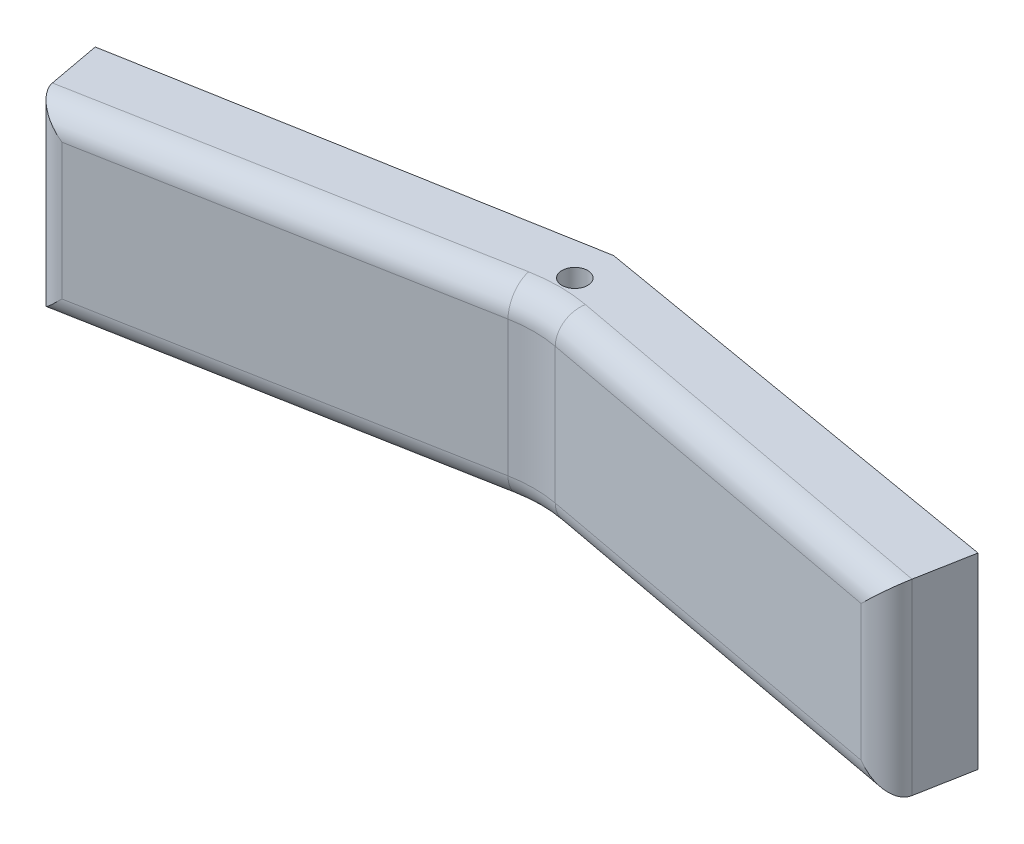
ISO-10303-21;
HEADER;
FILE_DESCRIPTION(('STEP AP214'),'2;1');
FILE_NAME('part.step','',(''),(''),'','','');
FILE_SCHEMA(('AUTOMOTIVE_DESIGN { 1 0 10303 214 1 1 1 1 }'));
ENDSEC;
DATA;
#1=APPLICATION_CONTEXT('core data for automotive mechanical design processes');
#2=APPLICATION_PROTOCOL_DEFINITION('international standard','automotive_design',2000,#1);
#3=PRODUCT_CONTEXT('',#1,'mechanical');
#4=PRODUCT('Part','Part','',(#3));
#5=PRODUCT_RELATED_PRODUCT_CATEGORY('part','',(#4));
#6=PRODUCT_DEFINITION_FORMATION('','',#4);
#7=PRODUCT_DEFINITION_CONTEXT('part definition',#1,'design');
#8=PRODUCT_DEFINITION('design','',#6,#7);
#9=PRODUCT_DEFINITION_SHAPE('','',#8);
#10=(LENGTH_UNIT() NAMED_UNIT(*) SI_UNIT(.MILLI.,.METRE.));
#11=(NAMED_UNIT(*) PLANE_ANGLE_UNIT() SI_UNIT($,.RADIAN.));
#12=(NAMED_UNIT(*) SI_UNIT($,.STERADIAN.) SOLID_ANGLE_UNIT());
#13=UNCERTAINTY_MEASURE_WITH_UNIT(LENGTH_MEASURE(1.E-05),#10,'distance_accuracy_value','');
#14=(GEOMETRIC_REPRESENTATION_CONTEXT(3) GLOBAL_UNCERTAINTY_ASSIGNED_CONTEXT((#13)) GLOBAL_UNIT_ASSIGNED_CONTEXT((#10,
#11,#12)) REPRESENTATION_CONTEXT('',''));
#15=CARTESIAN_POINT('',(0.,0.,0.));
#16=DIRECTION('',(0.,0.,1.));
#17=DIRECTION('',(1.,0.,0.));
#18=AXIS2_PLACEMENT_3D('',#15,#16,#17);
#19=CARTESIAN_POINT('',(70.,-30.,12.));
#20=DIRECTION('',(-0.182592193842776,0.,-0.983188736076488));
#21=DIRECTION('',(-0.983188736076488,0.,0.182592193842776));
#22=AXIS2_PLACEMENT_3D('',#19,#20,#21);
#23=PLANE('',#22);
#24=DIRECTION('',(0.,1.,0.));
#25=VECTOR('',#24,1.);
#26=CARTESIAN_POINT('',(8.14316476998033,-29.5,23.4876979712894));
#27=LINE('',#26,#25);
#28=CARTESIAN_POINT('',(8.14316476998033,-4.5,23.4876979712894));
#29=VERTEX_POINT('',#28);
#30=CARTESIAN_POINT('',(8.14316476998033,-25.5,23.4876979712894));
#31=VERTEX_POINT('',#30);
#32=EDGE_CURVE('E208',#29,#31,#27,.F.);
#33=ORIENTED_EDGE('',*,*,#32,.T.);
#34=DIRECTION('',(-0.983188736076488,0.,0.182592193842776));
#35=VECTOR('',#34,1.);
#36=CARTESIAN_POINT('',(66.3481561231445,-25.5,12.6781995771303));
#37=LINE('',#36,#35);
#38=CARTESIAN_POINT('',(66.3481561231445,-25.5,12.6781995771303));
#39=VERTEX_POINT('',#38);
#40=EDGE_CURVE('E211',#31,#39,#37,.F.);
#41=ORIENTED_EDGE('',*,*,#40,.T.);
#42=DIRECTION('',(0.,1.,0.));
#43=VECTOR('',#42,1.);
#44=CARTESIAN_POINT('',(66.3481561231445,-0.5,12.6781995771303));
#45=LINE('',#44,#43);
#46=CARTESIAN_POINT('',(66.3481561231445,-4.5,12.6781995771303));
#47=VERTEX_POINT('',#46);
#48=EDGE_CURVE('E181',#39,#47,#45,.T.);
#49=ORIENTED_EDGE('',*,*,#48,.T.);
#50=DIRECTION('',(0.983188736076488,0.,-0.182592193842776));
#51=VECTOR('',#50,1.);
#52=CARTESIAN_POINT('',(4.21040982567438,-4.5,24.2180667466605));
#53=LINE('',#52,#51);
#54=EDGE_CURVE('E205',#47,#29,#53,.F.);
#55=ORIENTED_EDGE('',*,*,#54,.T.);
#56=EDGE_LOOP('',(#33,#41,#49,#55));
#57=FACE_BOUND('',#56,.T.);
#58=ADVANCED_FACE('F47',(#57),#23,.F.);
#59=CARTESIAN_POINT('',(0.,-30.,12.5));
#60=DIRECTION('',(0.175790638483658,0.,0.984427575508482));
#61=DIRECTION('',(0.984427575508482,0.,-0.175790638483658));
#62=AXIS2_PLACEMENT_3D('',#59,#60,#61);
#63=PLANE('',#62);
#64=CARTESIAN_POINT('',(14.2813992262199,-15.,9.94975013817502));
#65=DIRECTION('',(-0.175790638483658,0.,-0.984427575508482));
#66=DIRECTION('',(-0.984427575508482,0.,0.175790638483658));
#67=AXIS2_PLACEMENT_3D('',#64,#65,#66);
#68=CIRCLE('',#67,2.5);
#69=CARTESIAN_POINT('',(11.8203302874487,-15.,10.3892267343842));
#70=VERTEX_POINT('',#69);
#71=EDGE_CURVE('E160',#70,#70,#68,.T.);
#72=ORIENTED_EDGE('',*,*,#71,.F.);
#73=EDGE_LOOP('',(#72));
#74=FACE_BOUND('',#73,.T.);
#75=DIRECTION('',(-0.984427575508482,0.,0.175790638483657));
#76=VECTOR('',#75,1.);
#77=CARTESIAN_POINT('',(70.,-0.5,0.));
#78=LINE('',#77,#76);
#79=CARTESIAN_POINT('',(70.,-0.5,0.));
#80=VERTEX_POINT('',#79);
#81=CARTESIAN_POINT('',(1.96890220372216,-0.5,12.1484103207639));
#82=VERTEX_POINT('',#81);
#83=EDGE_CURVE('E273',#80,#82,#78,.T.);
#84=ORIENTED_EDGE('',*,*,#83,.F.);
#85=DIRECTION('',(0.,1.,0.));
#86=VECTOR('',#85,1.);
#87=CARTESIAN_POINT('',(70.,-30.,0.));
#88=LINE('',#87,#86);
#89=CARTESIAN_POINT('',(70.,-29.5,0.));
#90=VERTEX_POINT('',#89);
#91=EDGE_CURVE('E151',#90,#80,#88,.T.);
#92=ORIENTED_EDGE('',*,*,#91,.F.);
#93=DIRECTION('',(0.984427575508482,0.,-0.175790638483657));
#94=VECTOR('',#93,1.);
#95=CARTESIAN_POINT('',(1.96890220372216,-29.5,12.1484103207639));
#96=LINE('',#95,#94);
#97=CARTESIAN_POINT('',(1.96890220372216,-29.5,12.1484103207639));
#98=VERTEX_POINT('',#97);
#99=EDGE_CURVE('E286',#98,#90,#96,.T.);
#100=ORIENTED_EDGE('',*,*,#99,.F.);
#101=DIRECTION('',(0.,-1.,0.));
#102=VECTOR('',#101,1.);
#103=CARTESIAN_POINT('',(1.96890220372216,-30.,12.1484103207639));
#104=LINE('',#103,#102);
#105=EDGE_CURVE('E177',#82,#98,#104,.T.);
#106=ORIENTED_EDGE('',*,*,#105,.F.);
#107=EDGE_LOOP('',(#84,#92,#100,#106));
#108=FACE_BOUND('',#107,.T.);
#109=ADVANCED_FACE('F334',(#74,#108),#63,.F.);
#110=CARTESIAN_POINT('',(70.,-30.,0.));
#111=DIRECTION('',(-0.168963815110846,0.,0.985622254813267));
#112=DIRECTION('',(0.985622254813267,0.,0.168963815110846));
#113=AXIS2_PLACEMENT_3D('',#110,#111,#112);
#114=PLANE('',#113);
#115=CARTESIAN_POINT('',(125.786219622431,-15.,9.56335193527388));
#116=DIRECTION('',(0.168963815110846,0.,-0.985622254813267));
#117=DIRECTION('',(-0.985622254813267,0.,-0.168963815110846));
#118=AXIS2_PLACEMENT_3D('',#115,#116,#117);
#119=CIRCLE('',#118,2.5);
#120=CARTESIAN_POINT('',(123.322163985398,-15.,9.14094239749676));
#121=VERTEX_POINT('',#120);
#122=EDGE_CURVE('E262',#121,#121,#119,.T.);
#123=ORIENTED_EDGE('',*,*,#122,.F.);
#124=EDGE_LOOP('',(#123));
#125=FACE_BOUND('',#124,.T.);
#126=DIRECTION('',(-0.985622254813267,0.,-0.168963815110846));
#127=VECTOR('',#126,1.);
#128=CARTESIAN_POINT('',(138.028566573112,-0.5,11.6620399839621));
#129=LINE('',#128,#127);
#130=CARTESIAN_POINT('',(138.028566573112,-0.5,11.6620399839621));
#131=VERTEX_POINT('',#130);
#132=EDGE_CURVE('E134',#131,#80,#129,.T.);
#133=ORIENTED_EDGE('',*,*,#132,.F.);
#134=DIRECTION('',(0.,1.,0.));
#135=VECTOR('',#134,1.);
#136=CARTESIAN_POINT('',(138.028566573112,-30.,11.6620399839621));
#137=LINE('',#136,#135);
#138=CARTESIAN_POINT('',(138.028566573112,-29.5,11.6620399839621));
#139=VERTEX_POINT('',#138);
#140=EDGE_CURVE('E149',#139,#131,#137,.T.);
#141=ORIENTED_EDGE('',*,*,#140,.F.);
#142=DIRECTION('',(0.985622254813267,0.,0.168963815110846));
#143=VECTOR('',#142,1.);
#144=CARTESIAN_POINT('',(70.,-29.5,0.));
#145=LINE('',#144,#143);
#146=EDGE_CURVE('E289',#90,#139,#145,.T.);
#147=ORIENTED_EDGE('',*,*,#146,.F.);
#148=ORIENTED_EDGE('',*,*,#91,.T.);
#149=EDGE_LOOP('',(#133,#141,#147,#148));
#150=FACE_BOUND('',#149,.T.);
#151=ADVANCED_FACE('F147',(#125,#150),#114,.F.);
#152=CARTESIAN_POINT('',(70.,-30.,12.));
#153=DIRECTION('',(0.182592193842776,0.,-0.983188736076488));
#154=DIRECTION('',(-0.983188736076488,0.,-0.182592193842776));
#155=AXIS2_PLACEMENT_3D('',#152,#153,#154);
#156=PLANE('',#155);
#157=DIRECTION('',(0.,1.,0.));
#158=VECTOR('',#157,1.);
#159=CARTESIAN_POINT('',(73.6518438768555,-29.5,12.6781995771303));
#160=LINE('',#159,#158);
#161=CARTESIAN_POINT('',(73.6518438768555,-4.5,12.6781995771303));
#162=VERTEX_POINT('',#161);
#163=CARTESIAN_POINT('',(73.6518438768555,-25.5,12.6781995771303));
#164=VERTEX_POINT('',#163);
#165=EDGE_CURVE('E185',#162,#164,#160,.F.);
#166=ORIENTED_EDGE('',*,*,#165,.T.);
#167=DIRECTION('',(-0.983188736076488,0.,-0.182592193842776));
#168=VECTOR('',#167,1.);
#169=CARTESIAN_POINT('',(135.699828880185,-25.5,24.2013967920343));
#170=LINE('',#169,#168);
#171=CARTESIAN_POINT('',(131.767073935879,-25.5,23.4710280166632));
#172=VERTEX_POINT('',#171);
#173=EDGE_CURVE('E57',#164,#172,#170,.F.);
#174=ORIENTED_EDGE('',*,*,#173,.T.);
#175=DIRECTION('',(0.,-1.,0.));
#176=VECTOR('',#175,1.);
#177=CARTESIAN_POINT('',(131.767073935879,-0.5,23.4710280166632));
#178=LINE('',#177,#176);
#179=CARTESIAN_POINT('',(131.767073935879,-4.5,23.4710280166632));
#180=VERTEX_POINT('',#179);
#181=EDGE_CURVE('E68',#172,#180,#178,.F.);
#182=ORIENTED_EDGE('',*,*,#181,.T.);
#183=DIRECTION('',(0.983188736076488,0.,0.182592193842776));
#184=VECTOR('',#183,1.);
#185=CARTESIAN_POINT('',(73.6518438768555,-4.5,12.6781995771303));
#186=LINE('',#185,#184);
#187=EDGE_CURVE('E225',#180,#162,#186,.F.);
#188=ORIENTED_EDGE('',*,*,#187,.T.);
#189=EDGE_LOOP('',(#166,#174,#182,#188));
#190=FACE_BOUND('',#189,.T.);
#191=ADVANCED_FACE('F342',(#190),#156,.F.);
#192=CARTESIAN_POINT('',(70.,0.,6.));
#193=DIRECTION('',(0.,-1.,0.));
#194=DIRECTION('',(0.,0.,-1.));
#195=AXIS2_PLACEMENT_3D('',#192,#193,#194);
#196=CYLINDRICAL_SURFACE('',#195,2.);
#197=CARTESIAN_POINT('',(70.,-29.5,6.));
#198=DIRECTION('',(0.,-1.,0.));
#199=DIRECTION('',(0.,0.,-1.));
#200=AXIS2_PLACEMENT_3D('',#197,#198,#199);
#201=CIRCLE('',#200,2.);
#202=CARTESIAN_POINT('',(70.,-29.5,4.));
#203=VERTEX_POINT('',#202);
#204=EDGE_CURVE('E161',#203,#203,#201,.F.);
#205=ORIENTED_EDGE('',*,*,#204,.F.);
#206=EDGE_LOOP('',(#205));
#207=FACE_BOUND('',#206,.T.);
#208=CARTESIAN_POINT('',(70.,-0.5,6.));
#209=DIRECTION('',(0.,1.,0.));
#210=DIRECTION('',(0.,0.,1.));
#211=AXIS2_PLACEMENT_3D('',#208,#209,#210);
#212=CIRCLE('',#211,2.);
#213=CARTESIAN_POINT('',(70.,-0.5,8.));
#214=VERTEX_POINT('',#213);
#215=EDGE_CURVE('E153',#214,#214,#212,.F.);
#216=ORIENTED_EDGE('',*,*,#215,.F.);
#217=EDGE_LOOP('',(#216));
#218=FACE_BOUND('',#217,.T.);
#219=ADVANCED_FACE('F348',(#207,#218),#196,.F.);
#220=CARTESIAN_POINT('',(135.520306291903,0.,25.168056882782));
#221=DIRECTION('',(0.983188736076488,0.,0.182592193842776));
#222=DIRECTION('',(0.182592193842776,0.,-0.983188736076488));
#223=AXIS2_PLACEMENT_3D('',#220,#221,#222);
#224=PLANE('',#223);
#225=DIRECTION('',(0.182592193842776,0.,-0.983188736076488));
#226=VECTOR('',#225,1.);
#227=CARTESIAN_POINT('',(135.699828880185,-0.5,24.2013967920343));
#228=LINE('',#227,#226);
#229=CARTESIAN_POINT('',(136.430197655556,-0.5,20.2686418477284));
#230=VERTEX_POINT('',#229);
#231=EDGE_CURVE('E129',#230,#131,#228,.T.);
#232=ORIENTED_EDGE('',*,*,#231,.F.);
#233=DIRECTION('',(0.,-1.,0.));
#234=VECTOR('',#233,1.);
#235=CARTESIAN_POINT('',(136.430197655556,-29.5,20.2686418477284));
#236=LINE('',#235,#234);
#237=CARTESIAN_POINT('',(136.430197655556,-29.5,20.2686418477284));
#238=VERTEX_POINT('',#237);
#239=EDGE_CURVE('E11',#230,#238,#236,.T.);
#240=ORIENTED_EDGE('',*,*,#239,.T.);
#241=DIRECTION('',(-0.182592193842776,0.,0.983188736076488));
#242=VECTOR('',#241,1.);
#243=CARTESIAN_POINT('',(138.028566573112,-29.5,11.6620399839621));
#244=LINE('',#243,#242);
#245=EDGE_CURVE('E158',#139,#238,#244,.T.);
#246=ORIENTED_EDGE('',*,*,#245,.F.);
#247=ORIENTED_EDGE('',*,*,#140,.T.);
#248=EDGE_LOOP('',(#232,#240,#246,#247));
#249=FACE_BOUND('',#248,.T.);
#250=ADVANCED_FACE('F156',(#249),#224,.T.);
#251=CARTESIAN_POINT('',(-0.277654881368432,0.,0.0515644779684231));
#252=DIRECTION('',(-0.983188736076488,0.,0.182592193842776));
#253=DIRECTION('',(0.182592193842776,0.,0.983188736076488));
#254=AXIS2_PLACEMENT_3D('',#251,#252,#253);
#255=PLANE('',#254);
#256=DIRECTION('',(-0.182592193842776,0.,-0.983188736076488));
#257=VECTOR('',#256,1.);
#258=CARTESIAN_POINT('',(4.21040982567438,-29.5,24.2180667466605));
#259=LINE('',#258,#257);
#260=CARTESIAN_POINT('',(3.48004105030327,-29.5,20.2853118023545));
#261=VERTEX_POINT('',#260);
#262=EDGE_CURVE('E283',#261,#98,#259,.T.);
#263=ORIENTED_EDGE('',*,*,#262,.F.);
#264=DIRECTION('',(0.,1.,0.));
#265=VECTOR('',#264,1.);
#266=CARTESIAN_POINT('',(3.48004105030327,-0.5,20.2853118023545));
#267=LINE('',#266,#265);
#268=CARTESIAN_POINT('',(3.48004105030327,-0.5,20.2853118023545));
#269=VERTEX_POINT('',#268);
#270=EDGE_CURVE('E214',#261,#269,#267,.T.);
#271=ORIENTED_EDGE('',*,*,#270,.T.);
#272=DIRECTION('',(0.182592193842776,0.,0.983188736076488));
#273=VECTOR('',#272,1.);
#274=CARTESIAN_POINT('',(1.96890220372216,-0.5,12.1484103207639));
#275=LINE('',#274,#273);
#276=EDGE_CURVE('E142',#82,#269,#275,.T.);
#277=ORIENTED_EDGE('',*,*,#276,.F.);
#278=ORIENTED_EDGE('',*,*,#105,.T.);
#279=EDGE_LOOP('',(#263,#271,#277,#278));
#280=FACE_BOUND('',#279,.T.);
#281=ADVANCED_FACE('F313',(#280),#255,.T.);
#282=CARTESIAN_POINT('',(14.8087711416709,-15.,12.9030328647005));
#283=DIRECTION('',(-0.175790638483658,0.,-0.984427575508482));
#284=DIRECTION('',(-0.984427575508482,0.,0.175790638483658));
#285=AXIS2_PLACEMENT_3D('',#282,#283,#284);
#286=CYLINDRICAL_SURFACE('',#285,2.5);
#287=CARTESIAN_POINT('',(14.8087711416709,-15.,12.9030328647005));
#288=DIRECTION('',(-0.175790638483658,0.,-0.984427575508482));
#289=DIRECTION('',(-0.984427575508482,0.,0.175790638483658));
#290=AXIS2_PLACEMENT_3D('',#287,#288,#289);
#291=CIRCLE('',#290,2.5);
#292=CARTESIAN_POINT('',(12.3477022028997,-15.,13.3425094609096));
#293=VERTEX_POINT('',#292);
#294=EDGE_CURVE('E166',#293,#293,#291,.T.);
#295=ORIENTED_EDGE('',*,*,#294,.F.);
#296=EDGE_LOOP('',(#295));
#297=FACE_BOUND('',#296,.T.);
#298=ORIENTED_EDGE('',*,*,#71,.T.);
#299=EDGE_LOOP('',(#298));
#300=FACE_BOUND('',#299,.T.);
#301=ADVANCED_FACE('F412',(#297,#300),#286,.F.);
#302=CARTESIAN_POINT('',(14.8087711416709,-15.,12.9030328647005));
#303=DIRECTION('',(-0.175790638483658,0.,-0.984427575508482));
#304=DIRECTION('',(-0.984427575508482,0.,0.175790638483658));
#305=AXIS2_PLACEMENT_3D('',#302,#303,#304);
#306=PLANE('',#305);
#307=ORIENTED_EDGE('',*,*,#294,.T.);
#308=EDGE_LOOP('',(#307));
#309=FACE_BOUND('',#308,.T.);
#310=ADVANCED_FACE('F405',(#309),#306,.T.);
#311=CARTESIAN_POINT('',(0.,-29.5,0.));
#312=DIRECTION('',(0.,-1.,0.));
#313=DIRECTION('',(0.,0.,-1.));
#314=AXIS2_PLACEMENT_3D('',#311,#312,#313);
#315=PLANE('',#314);
#316=CARTESIAN_POINT('',(70.,-29.5,32.3419742986601));
#317=DIRECTION('',(0.,-1.,0.));
#318=DIRECTION('',(0.,0.,-1.));
#319=AXIS2_PLACEMENT_3D('',#316,#317,#318);
#320=CIRCLE('',#319,24.);
#321=CARTESIAN_POINT('',(74.3822126522266,-29.5,8.74544463282436));
#322=VERTEX_POINT('',#321);
#323=CARTESIAN_POINT('',(65.6177873477734,-29.5,8.74544463282436));
#324=VERTEX_POINT('',#323);
#325=EDGE_CURVE('E191',#322,#324,#320,.F.);
#326=ORIENTED_EDGE('',*,*,#325,.T.);
#327=DIRECTION('',(-0.983188736076488,0.,0.182592193842776));
#328=VECTOR('',#327,1.);
#329=CARTESIAN_POINT('',(3.48004105030328,-29.5,20.2853118023545));
#330=LINE('',#329,#328);
#331=EDGE_CURVE('E195',#324,#261,#330,.T.);
#332=ORIENTED_EDGE('',*,*,#331,.T.);
#333=ORIENTED_EDGE('',*,*,#262,.T.);
#334=ORIENTED_EDGE('',*,*,#99,.T.);
#335=ORIENTED_EDGE('',*,*,#146,.T.);
#336=ORIENTED_EDGE('',*,*,#245,.T.);
#337=DIRECTION('',(-0.983188736076488,0.,-0.182592193842776));
#338=VECTOR('',#337,1.);
#339=CARTESIAN_POINT('',(74.3822126522266,-29.5,8.74544463282436));
#340=LINE('',#339,#338);
#341=EDGE_CURVE('E188',#238,#322,#340,.T.);
#342=ORIENTED_EDGE('',*,*,#341,.T.);
#343=EDGE_LOOP('',(#326,#332,#333,#334,#335,#336,#342));
#344=FACE_BOUND('',#343,.T.);
#345=ORIENTED_EDGE('',*,*,#204,.T.);
#346=EDGE_LOOP('',(#345));
#347=FACE_BOUND('',#346,.T.);
#348=ADVANCED_FACE('F294',(#344,#347),#315,.T.);
#349=CARTESIAN_POINT('',(0.,-0.5,0.));
#350=DIRECTION('',(0.,1.,0.));
#351=DIRECTION('',(0.,0.,1.));
#352=AXIS2_PLACEMENT_3D('',#349,#350,#351);
#353=PLANE('',#352);
#354=ORIENTED_EDGE('',*,*,#276,.T.);
#355=DIRECTION('',(0.983188736076488,0.,-0.182592193842776));
#356=VECTOR('',#355,1.);
#357=CARTESIAN_POINT('',(65.6177873477734,-0.5,8.74544463282436));
#358=LINE('',#357,#356);
#359=CARTESIAN_POINT('',(65.6177873477734,-0.5,8.74544463282436));
#360=VERTEX_POINT('',#359);
#361=EDGE_CURVE('E222',#269,#360,#358,.T.);
#362=ORIENTED_EDGE('',*,*,#361,.T.);
#363=CARTESIAN_POINT('',(70.,-0.5,32.3419742986601));
#364=DIRECTION('',(0.,1.,0.));
#365=DIRECTION('',(0.,0.,1.));
#366=AXIS2_PLACEMENT_3D('',#363,#364,#365);
#367=CIRCLE('',#366,24.);
#368=CARTESIAN_POINT('',(74.3822126522266,-0.5,8.74544463282436));
#369=VERTEX_POINT('',#368);
#370=EDGE_CURVE('E219',#360,#369,#367,.F.);
#371=ORIENTED_EDGE('',*,*,#370,.T.);
#372=DIRECTION('',(0.983188736076488,0.,0.182592193842776));
#373=VECTOR('',#372,1.);
#374=CARTESIAN_POINT('',(136.430197655556,-0.5,20.2686418477284));
#375=LINE('',#374,#373);
#376=EDGE_CURVE('E137',#369,#230,#375,.T.);
#377=ORIENTED_EDGE('',*,*,#376,.T.);
#378=ORIENTED_EDGE('',*,*,#231,.T.);
#379=ORIENTED_EDGE('',*,*,#132,.T.);
#380=ORIENTED_EDGE('',*,*,#83,.T.);
#381=EDGE_LOOP('',(#354,#362,#371,#377,#378,#379,#380));
#382=FACE_BOUND('',#381,.T.);
#383=ORIENTED_EDGE('',*,*,#215,.T.);
#384=EDGE_LOOP('',(#383));
#385=FACE_BOUND('',#384,.T.);
#386=ADVANCED_FACE('F132',(#382,#385),#353,.T.);
#387=CARTESIAN_POINT('',(125.279328177098,-15.,12.5202186997137));
#388=DIRECTION('',(0.168963815110846,0.,-0.985622254813267));
#389=DIRECTION('',(-0.985622254813267,0.,-0.168963815110846));
#390=AXIS2_PLACEMENT_3D('',#387,#388,#389);
#391=CYLINDRICAL_SURFACE('',#390,2.5);
#392=CARTESIAN_POINT('',(125.279328177098,-15.,12.5202186997137));
#393=DIRECTION('',(0.168963815110846,0.,-0.985622254813267));
#394=DIRECTION('',(-0.985622254813267,0.,-0.168963815110846));
#395=AXIS2_PLACEMENT_3D('',#392,#393,#394);
#396=CIRCLE('',#395,2.5);
#397=CARTESIAN_POINT('',(122.815272540065,-15.,12.0978091619366));
#398=VERTEX_POINT('',#397);
#399=EDGE_CURVE('E267',#398,#398,#396,.T.);
#400=ORIENTED_EDGE('',*,*,#399,.F.);
#401=EDGE_LOOP('',(#400));
#402=FACE_BOUND('',#401,.T.);
#403=ORIENTED_EDGE('',*,*,#122,.T.);
#404=EDGE_LOOP('',(#403));
#405=FACE_BOUND('',#404,.T.);
#406=ADVANCED_FACE('F384',(#402,#405),#391,.F.);
#407=CARTESIAN_POINT('',(125.279328177098,-15.,12.5202186997137));
#408=DIRECTION('',(0.168963815110846,0.,-0.985622254813267));
#409=DIRECTION('',(-0.985622254813267,0.,-0.168963815110846));
#410=AXIS2_PLACEMENT_3D('',#407,#408,#409);
#411=PLANE('',#410);
#412=ORIENTED_EDGE('',*,*,#399,.T.);
#413=EDGE_LOOP('',(#412));
#414=FACE_BOUND('',#413,.T.);
#415=ADVANCED_FACE('F355',(#414),#411,.T.);
#416=CARTESIAN_POINT('',(70.,-30.,32.3419742986601));
#417=DIRECTION('',(0.,-1.,0.));
#418=DIRECTION('',(0.,0.,-1.));
#419=AXIS2_PLACEMENT_3D('',#416,#417,#418);
#420=CYLINDRICAL_SURFACE('',#419,20.);
#421=ORIENTED_EDGE('',*,*,#48,.F.);
#422=CARTESIAN_POINT('',(70.,-25.5,32.3419742986601));
#423=DIRECTION('',(0.,-1.,0.));
#424=DIRECTION('',(0.,0.,-1.));
#425=AXIS2_PLACEMENT_3D('',#422,#423,#424);
#426=CIRCLE('',#425,20.);
#427=EDGE_CURVE('E201',#39,#164,#426,.T.);
#428=ORIENTED_EDGE('',*,*,#427,.T.);
#429=ORIENTED_EDGE('',*,*,#165,.F.);
#430=CARTESIAN_POINT('',(70.,-4.5,32.3419742986601));
#431=DIRECTION('',(0.,1.,0.));
#432=DIRECTION('',(0.,0.,1.));
#433=AXIS2_PLACEMENT_3D('',#430,#431,#432);
#434=CIRCLE('',#433,20.);
#435=EDGE_CURVE('E198',#162,#47,#434,.T.);
#436=ORIENTED_EDGE('',*,*,#435,.T.);
#437=EDGE_LOOP('',(#421,#428,#429,#436));
#438=FACE_BOUND('',#437,.T.);
#439=ADVANCED_FACE('F327',(#438),#420,.F.);
#440=CARTESIAN_POINT('',(70.,-4.5,32.3419742986601));
#441=DIRECTION('',(0.,1.,0.));
#442=DIRECTION('',(0.,0.,1.));
#443=AXIS2_PLACEMENT_3D('',#440,#441,#442);
#444=TOROIDAL_SURFACE('',#443,24.,4.);
#445=CARTESIAN_POINT('',(65.6177873477734,-4.5,8.74544463282436));
#446=DIRECTION('',(-0.983188736076488,0.,0.182592193842777));
#447=DIRECTION('',(0.182592193842777,0.,0.983188736076488));
#448=AXIS2_PLACEMENT_3D('',#445,#446,#447);
#449=CIRCLE('',#448,4.);
#450=EDGE_CURVE('E253',#47,#360,#449,.T.);
#451=ORIENTED_EDGE('',*,*,#450,.F.);
#452=ORIENTED_EDGE('',*,*,#435,.F.);
#453=CARTESIAN_POINT('',(74.3822126522266,-4.5,8.74544463282436));
#454=DIRECTION('',(0.983188736076488,0.,0.182592193842777));
#455=DIRECTION('',(0.182592193842777,0.,-0.983188736076488));
#456=AXIS2_PLACEMENT_3D('',#453,#454,#455);
#457=CIRCLE('',#456,4.);
#458=EDGE_CURVE('E51',#369,#162,#457,.T.);
#459=ORIENTED_EDGE('',*,*,#458,.F.);
#460=ORIENTED_EDGE('',*,*,#370,.F.);
#461=EDGE_LOOP('',(#451,#452,#459,#460));
#462=FACE_BOUND('',#461,.T.);
#463=ADVANCED_FACE('F49',(#462),#444,.T.);
#464=CARTESIAN_POINT('',(0.909891363652818,-4.5,-4.89941503505364));
#465=DIRECTION('',(-0.983188736076488,0.,-0.182592193842776));
#466=DIRECTION('',(-0.182592193842776,0.,0.983188736076488));
#467=AXIS2_PLACEMENT_3D('',#464,#465,#466);
#468=CYLINDRICAL_SURFACE('',#467,4.);
#469=ORIENTED_EDGE('',*,*,#458,.T.);
#470=ORIENTED_EDGE('',*,*,#187,.F.);
#471=CARTESIAN_POINT('',(132.49744271125,-4.5,19.5382730723573));
#472=DIRECTION('',(-0.695219422465915,0.707106781186547,-0.129112178457956));
#473=DIRECTION('',(-0.695219422465915,-0.707106781186547,-0.129112178457956));
#474=AXIS2_PLACEMENT_3D('',#471,#472,#473);
#475=ELLIPSE('',#474,5.65685424949238,4.);
#476=EDGE_CURVE('E250',#230,#180,#475,.F.);
#477=ORIENTED_EDGE('',*,*,#476,.F.);
#478=ORIENTED_EDGE('',*,*,#376,.F.);
#479=EDGE_LOOP('',(#469,#470,#477,#478));
#480=FACE_BOUND('',#479,.T.);
#481=ADVANCED_FACE('F367',(#480),#468,.T.);
#482=CARTESIAN_POINT('',(3.7576959316717,-4.5,20.2337473243861));
#483=DIRECTION('',(-0.983188736076488,0.,0.182592193842776));
#484=DIRECTION('',(0.182592193842776,0.,0.983188736076488));
#485=AXIS2_PLACEMENT_3D('',#482,#483,#484);
#486=CYLINDRICAL_SURFACE('',#485,4.);
#487=ORIENTED_EDGE('',*,*,#450,.T.);
#488=ORIENTED_EDGE('',*,*,#361,.F.);
#489=CARTESIAN_POINT('',(7.41279599460923,-4.5,19.5549430269834));
#490=DIRECTION('',(-0.695219422465915,-0.707106781186547,0.129112178457956));
#491=DIRECTION('',(-0.695219422465915,0.707106781186547,0.129112178457956));
#492=AXIS2_PLACEMENT_3D('',#489,#490,#491);
#493=ELLIPSE('',#492,5.65685424949238,4.);
#494=EDGE_CURVE('E246',#29,#269,#493,.T.);
#495=ORIENTED_EDGE('',*,*,#494,.F.);
#496=ORIENTED_EDGE('',*,*,#54,.F.);
#497=EDGE_LOOP('',(#487,#488,#495,#496));
#498=FACE_BOUND('',#497,.T.);
#499=ADVANCED_FACE('F332',(#498),#486,.T.);
#500=CARTESIAN_POINT('',(132.49744271125,0.,19.5382730723573));
#501=DIRECTION('',(0.,1.,0.));
#502=DIRECTION('',(0.,0.,1.));
#503=AXIS2_PLACEMENT_3D('',#500,#501,#502);
#504=CYLINDRICAL_SURFACE('',#503,4.);
#505=ORIENTED_EDGE('',*,*,#476,.T.);
#506=ORIENTED_EDGE('',*,*,#181,.F.);
#507=CARTESIAN_POINT('',(132.49744271125,-25.5,19.5382730723573));
#508=DIRECTION('',(0.695219422465915,0.707106781186547,0.129112178457956));
#509=DIRECTION('',(-0.695219422465915,0.707106781186547,-0.129112178457956));
#510=AXIS2_PLACEMENT_3D('',#507,#508,#509);
#511=ELLIPSE('',#510,5.65685424949238,4.);
#512=EDGE_CURVE('E242',#238,#172,#511,.F.);
#513=ORIENTED_EDGE('',*,*,#512,.F.);
#514=ORIENTED_EDGE('',*,*,#239,.F.);
#515=EDGE_LOOP('',(#505,#506,#513,#514));
#516=FACE_BOUND('',#515,.T.);
#517=ADVANCED_FACE('F300',(#516),#504,.T.);
#518=CARTESIAN_POINT('',(7.41279599460923,0.,19.5549430269834));
#519=DIRECTION('',(0.,-1.,0.));
#520=DIRECTION('',(0.,0.,-1.));
#521=AXIS2_PLACEMENT_3D('',#518,#519,#520);
#522=CYLINDRICAL_SURFACE('',#521,4.);
#523=ORIENTED_EDGE('',*,*,#494,.T.);
#524=ORIENTED_EDGE('',*,*,#270,.F.);
#525=CARTESIAN_POINT('',(7.41279599460923,-25.5,19.5549430269834));
#526=DIRECTION('',(0.695219422465915,-0.707106781186547,-0.129112178457956));
#527=DIRECTION('',(-0.695219422465915,-0.707106781186547,0.129112178457956));
#528=AXIS2_PLACEMENT_3D('',#525,#526,#527);
#529=ELLIPSE('',#528,5.65685424949238,4.);
#530=EDGE_CURVE('E238',#31,#261,#529,.T.);
#531=ORIENTED_EDGE('',*,*,#530,.F.);
#532=ORIENTED_EDGE('',*,*,#32,.F.);
#533=EDGE_LOOP('',(#523,#524,#531,#532));
#534=FACE_BOUND('',#533,.T.);
#535=ADVANCED_FACE('F319',(#534),#522,.T.);
#536=CARTESIAN_POINT('',(0.909891363652818,-25.5,-4.89941503505364));
#537=DIRECTION('',(0.983188736076488,0.,0.182592193842776));
#538=DIRECTION('',(0.182592193842776,0.,-0.983188736076488));
#539=AXIS2_PLACEMENT_3D('',#536,#537,#538);
#540=CYLINDRICAL_SURFACE('',#539,4.);
#541=ORIENTED_EDGE('',*,*,#512,.T.);
#542=ORIENTED_EDGE('',*,*,#173,.F.);
#543=CARTESIAN_POINT('',(74.3822126522266,-25.5,8.74544463282436));
#544=DIRECTION('',(-0.983188736076488,0.,-0.182592193842777));
#545=DIRECTION('',(-0.182592193842777,0.,0.983188736076488));
#546=AXIS2_PLACEMENT_3D('',#543,#544,#545);
#547=CIRCLE('',#546,4.);
#548=EDGE_CURVE('E235',#322,#164,#547,.T.);
#549=ORIENTED_EDGE('',*,*,#548,.F.);
#550=ORIENTED_EDGE('',*,*,#341,.F.);
#551=EDGE_LOOP('',(#541,#542,#549,#550));
#552=FACE_BOUND('',#551,.T.);
#553=ADVANCED_FACE('F302',(#552),#540,.T.);
#554=CARTESIAN_POINT('',(3.7576959316717,-25.5,20.2337473243861));
#555=DIRECTION('',(0.983188736076488,0.,-0.182592193842776));
#556=DIRECTION('',(-0.182592193842776,0.,-0.983188736076488));
#557=AXIS2_PLACEMENT_3D('',#554,#555,#556);
#558=CYLINDRICAL_SURFACE('',#557,4.);
#559=ORIENTED_EDGE('',*,*,#530,.T.);
#560=ORIENTED_EDGE('',*,*,#331,.F.);
#561=CARTESIAN_POINT('',(65.6177873477734,-25.5,8.74544463282436));
#562=DIRECTION('',(0.983188736076488,0.,-0.182592193842777));
#563=DIRECTION('',(-0.182592193842777,0.,-0.983188736076488));
#564=AXIS2_PLACEMENT_3D('',#561,#562,#563);
#565=CIRCLE('',#564,4.);
#566=EDGE_CURVE('E232',#39,#324,#565,.T.);
#567=ORIENTED_EDGE('',*,*,#566,.F.);
#568=ORIENTED_EDGE('',*,*,#40,.F.);
#569=EDGE_LOOP('',(#559,#560,#567,#568));
#570=FACE_BOUND('',#569,.T.);
#571=ADVANCED_FACE('F323',(#570),#558,.T.);
#572=CARTESIAN_POINT('',(70.,-25.5,32.3419742986601));
#573=DIRECTION('',(0.,-1.,0.));
#574=DIRECTION('',(0.,0.,-1.));
#575=AXIS2_PLACEMENT_3D('',#572,#573,#574);
#576=TOROIDAL_SURFACE('',#575,24.,4.);
#577=ORIENTED_EDGE('',*,*,#548,.T.);
#578=ORIENTED_EDGE('',*,*,#427,.F.);
#579=ORIENTED_EDGE('',*,*,#566,.T.);
#580=ORIENTED_EDGE('',*,*,#325,.F.);
#581=EDGE_LOOP('',(#577,#578,#579,#580));
#582=FACE_BOUND('',#581,.T.);
#583=ADVANCED_FACE('F306',(#582),#576,.T.);
#584=CLOSED_SHELL('',(#58,#109,#151,#191,#219,#250,#281,#301,#310,#348,#386,#406,#415,#439,#463,
#481,#499,#517,#535,#553,#571,#583));
#585=MANIFOLD_SOLID_BREP('B2',#584);
#586=ADVANCED_BREP_SHAPE_REPRESENTATION('',(#18,#585),#14);
#587=SHAPE_DEFINITION_REPRESENTATION(#9,#586);
ENDSEC;
END-ISO-10303-21;
